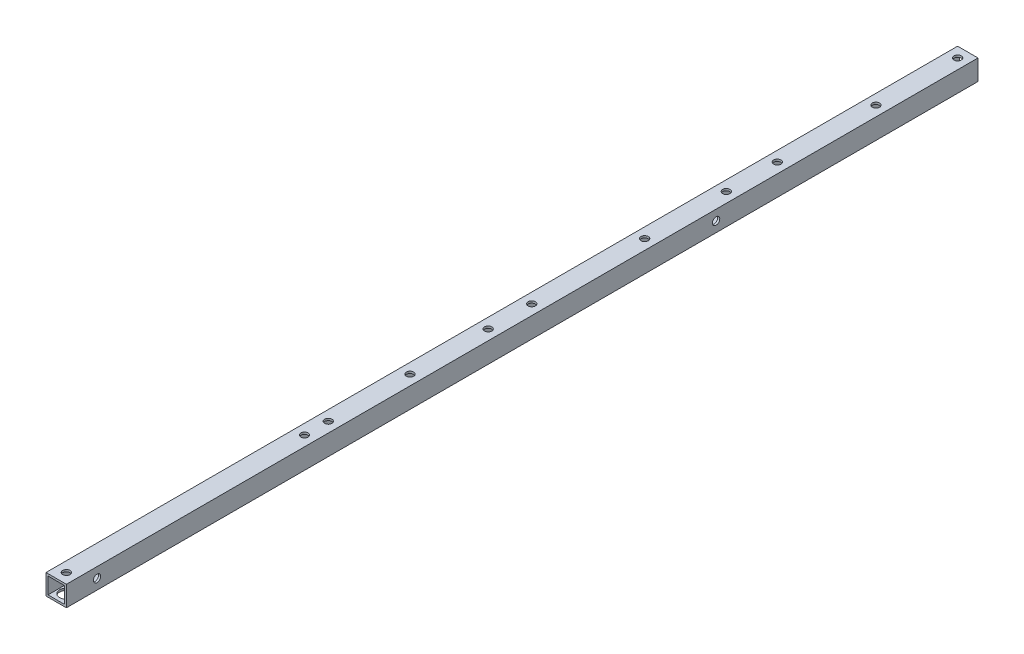
ISO-10303-21;
HEADER;
FILE_DESCRIPTION(('STEP AP214'),'2;1');
FILE_NAME('part.step','',(''),(''),'','','');
FILE_SCHEMA(('AUTOMOTIVE_DESIGN { 1 0 10303 214 1 1 1 1 }'));
ENDSEC;
DATA;
#1=APPLICATION_CONTEXT('core data for automotive mechanical design processes');
#2=APPLICATION_PROTOCOL_DEFINITION('international standard','automotive_design',2000,#1);
#3=PRODUCT_CONTEXT('',#1,'mechanical');
#4=PRODUCT('Part','Part','',(#3));
#5=PRODUCT_RELATED_PRODUCT_CATEGORY('part','',(#4));
#6=PRODUCT_DEFINITION_FORMATION('','',#4);
#7=PRODUCT_DEFINITION_CONTEXT('part definition',#1,'design');
#8=PRODUCT_DEFINITION('design','',#6,#7);
#9=PRODUCT_DEFINITION_SHAPE('','',#8);
#10=(LENGTH_UNIT() NAMED_UNIT(*) SI_UNIT(.MILLI.,.METRE.));
#11=(NAMED_UNIT(*) PLANE_ANGLE_UNIT() SI_UNIT($,.RADIAN.));
#12=(NAMED_UNIT(*) SI_UNIT($,.STERADIAN.) SOLID_ANGLE_UNIT());
#13=UNCERTAINTY_MEASURE_WITH_UNIT(LENGTH_MEASURE(1.E-05),#10,'distance_accuracy_value','');
#14=(GEOMETRIC_REPRESENTATION_CONTEXT(3) GLOBAL_UNCERTAINTY_ASSIGNED_CONTEXT((#13)) GLOBAL_UNIT_ASSIGNED_CONTEXT((#10,
#11,#12)) REPRESENTATION_CONTEXT('',''));
#15=CARTESIAN_POINT('',(0.,0.,0.));
#16=DIRECTION('',(0.,0.,1.));
#17=DIRECTION('',(1.,0.,0.));
#18=AXIS2_PLACEMENT_3D('',#15,#16,#17);
#19=CARTESIAN_POINT('',(-6.,-6.,670.));
#20=DIRECTION('',(0.,1.,0.));
#21=DIRECTION('',(0.,0.,1.));
#22=AXIS2_PLACEMENT_3D('',#19,#20,#21);
#23=PLANE('',#22);
#24=CARTESIAN_POINT('',(0.,-6.,320.5));
#25=DIRECTION('',(0.,1.,0.));
#26=DIRECTION('',(0.,0.,1.));
#27=AXIS2_PLACEMENT_3D('',#24,#25,#26);
#28=CIRCLE('',#27,4.99999999999999);
#29=CARTESIAN_POINT('',(0.,-6.,325.5));
#30=VERTEX_POINT('',#29);
#31=EDGE_CURVE('E638',#30,#30,#28,.F.);
#32=ORIENTED_EDGE('',*,*,#31,.T.);
#33=EDGE_LOOP('',(#32));
#34=FACE_BOUND('',#33,.T.);
#35=CARTESIAN_POINT('',(0.,-6.,662.5));
#36=DIRECTION('',(0.,1.,0.));
#37=DIRECTION('',(0.,0.,1.));
#38=AXIS2_PLACEMENT_3D('',#35,#36,#37);
#39=CIRCLE('',#38,5.00000000000001);
#40=CARTESIAN_POINT('',(0.,-6.,667.5));
#41=VERTEX_POINT('',#40);
#42=EDGE_CURVE('E196',#41,#41,#39,.T.);
#43=ORIENTED_EDGE('',*,*,#42,.F.);
#44=EDGE_LOOP('',(#43));
#45=FACE_BOUND('',#44,.T.);
#46=CARTESIAN_POINT('',(4.19131769982024E-12,-6.,410.));
#47=DIRECTION('',(0.,1.,0.));
#48=DIRECTION('',(0.,0.,1.));
#49=AXIS2_PLACEMENT_3D('',#46,#47,#48);
#50=CIRCLE('',#49,5.);
#51=CARTESIAN_POINT('',(4.19131769982024E-12,-6.,415.));
#52=VERTEX_POINT('',#51);
#53=EDGE_CURVE('E193',#52,#52,#50,.T.);
#54=ORIENTED_EDGE('',*,*,#53,.F.);
#55=EDGE_LOOP('',(#54));
#56=FACE_BOUND('',#55,.T.);
#57=CARTESIAN_POINT('',(5.84886213538092E-12,-6.,67.4999999999999));
#58=DIRECTION('',(0.,1.,0.));
#59=DIRECTION('',(0.,0.,1.));
#60=AXIS2_PLACEMENT_3D('',#57,#58,#59);
#61=CIRCLE('',#60,5.);
#62=CARTESIAN_POINT('',(5.84886213538092E-12,-6.,72.5));
#63=VERTEX_POINT('',#62);
#64=EDGE_CURVE('E190',#63,#63,#61,.T.);
#65=ORIENTED_EDGE('',*,*,#64,.F.);
#66=EDGE_LOOP('',(#65));
#67=FACE_BOUND('',#66,.T.);
#68=CARTESIAN_POINT('',(-3.10649990647104E-12,-6.,7.50000000000001));
#69=DIRECTION('',(0.,1.,0.));
#70=DIRECTION('',(0.,0.,1.));
#71=AXIS2_PLACEMENT_3D('',#68,#69,#70);
#72=CIRCLE('',#71,5.);
#73=CARTESIAN_POINT('',(-3.10649990647104E-12,-6.,12.5));
#74=VERTEX_POINT('',#73);
#75=EDGE_CURVE('E187',#74,#74,#72,.T.);
#76=ORIENTED_EDGE('',*,*,#75,.F.);
#77=EDGE_LOOP('',(#76));
#78=FACE_BOUND('',#77,.T.);
#79=CARTESIAN_POINT('',(0.,-6.,140.));
#80=DIRECTION('',(0.,1.,0.));
#81=DIRECTION('',(0.,0.,1.));
#82=AXIS2_PLACEMENT_3D('',#79,#80,#81);
#83=CIRCLE('',#82,5.);
#84=CARTESIAN_POINT('',(0.,-6.,145.));
#85=VERTEX_POINT('',#84);
#86=EDGE_CURVE('E184',#85,#85,#83,.T.);
#87=ORIENTED_EDGE('',*,*,#86,.F.);
#88=EDGE_LOOP('',(#87));
#89=FACE_BOUND('',#88,.T.);
#90=CARTESIAN_POINT('',(4.19131769982024E-12,-6.,470.));
#91=DIRECTION('',(0.,1.,0.));
#92=DIRECTION('',(0.,0.,1.));
#93=AXIS2_PLACEMENT_3D('',#90,#91,#92);
#94=CIRCLE('',#93,5.);
#95=CARTESIAN_POINT('',(4.19131769982024E-12,-6.,475.));
#96=VERTEX_POINT('',#95);
#97=EDGE_CURVE('E181',#96,#96,#94,.T.);
#98=ORIENTED_EDGE('',*,*,#97,.F.);
#99=EDGE_LOOP('',(#98));
#100=FACE_BOUND('',#99,.T.);
#101=CARTESIAN_POINT('',(0.,-6.,487.5));
#102=DIRECTION('',(0.,1.,0.));
#103=DIRECTION('',(0.,0.,1.));
#104=AXIS2_PLACEMENT_3D('',#101,#102,#103);
#105=CIRCLE('',#104,5.);
#106=CARTESIAN_POINT('',(0.,-6.,492.5));
#107=VERTEX_POINT('',#106);
#108=EDGE_CURVE('E178',#107,#107,#105,.T.);
#109=ORIENTED_EDGE('',*,*,#108,.F.);
#110=EDGE_LOOP('',(#109));
#111=FACE_BOUND('',#110,.T.);
#112=CARTESIAN_POINT('',(-4.63274860979666E-13,-6.,352.5));
#113=DIRECTION('',(0.,1.,0.));
#114=DIRECTION('',(0.,0.,1.));
#115=AXIS2_PLACEMENT_3D('',#112,#113,#114);
#116=CIRCLE('',#115,5.);
#117=CARTESIAN_POINT('',(-4.63274860979666E-13,-6.,357.5));
#118=VERTEX_POINT('',#117);
#119=EDGE_CURVE('E174',#118,#118,#116,.T.);
#120=ORIENTED_EDGE('',*,*,#119,.F.);
#121=EDGE_LOOP('',(#120));
#122=FACE_BOUND('',#121,.T.);
#123=CARTESIAN_POINT('',(0.,-6.,177.5));
#124=DIRECTION('',(0.,1.,0.));
#125=DIRECTION('',(0.,0.,1.));
#126=AXIS2_PLACEMENT_3D('',#123,#124,#125);
#127=CIRCLE('',#126,5.);
#128=CARTESIAN_POINT('',(0.,-6.,182.5));
#129=VERTEX_POINT('',#128);
#130=EDGE_CURVE('E171',#129,#129,#127,.T.);
#131=ORIENTED_EDGE('',*,*,#130,.F.);
#132=EDGE_LOOP('',(#131));
#133=FACE_BOUND('',#132,.T.);
#134=DIRECTION('',(1.,0.,0.));
#135=VECTOR('',#134,1.);
#136=CARTESIAN_POINT('',(-6.,-6.,0.));
#137=LINE('',#136,#135);
#138=CARTESIAN_POINT('',(-6.,-6.,0.));
#139=VERTEX_POINT('',#138);
#140=CARTESIAN_POINT('',(6.,-6.,0.));
#141=VERTEX_POINT('',#140);
#142=EDGE_CURVE('E116',#139,#141,#137,.T.);
#143=ORIENTED_EDGE('',*,*,#142,.F.);
#144=DIRECTION('',(0.,0.,-1.));
#145=VECTOR('',#144,1.);
#146=CARTESIAN_POINT('',(-6.,-6.,670.));
#147=LINE('',#146,#145);
#148=CARTESIAN_POINT('',(-6.,-6.,670.));
#149=VERTEX_POINT('',#148);
#150=EDGE_CURVE('E57',#149,#139,#147,.T.);
#151=ORIENTED_EDGE('',*,*,#150,.F.);
#152=DIRECTION('',(1.,0.,0.));
#153=VECTOR('',#152,1.);
#154=CARTESIAN_POINT('',(-6.,-6.,670.));
#155=LINE('',#154,#153);
#156=CARTESIAN_POINT('',(6.,-6.,670.));
#157=VERTEX_POINT('',#156);
#158=EDGE_CURVE('E130',#149,#157,#155,.T.);
#159=ORIENTED_EDGE('',*,*,#158,.T.);
#160=DIRECTION('',(0.,0.,-1.));
#161=VECTOR('',#160,1.);
#162=CARTESIAN_POINT('',(6.,-6.,670.));
#163=LINE('',#162,#161);
#164=EDGE_CURVE('E111',#157,#141,#163,.T.);
#165=ORIENTED_EDGE('',*,*,#164,.T.);
#166=EDGE_LOOP('',(#143,#151,#159,#165));
#167=FACE_BOUND('',#166,.T.);
#168=CARTESIAN_POINT('',(0.,-6.,237.5));
#169=DIRECTION('',(0.,1.,0.));
#170=DIRECTION('',(0.,0.,1.));
#171=AXIS2_PLACEMENT_3D('',#168,#169,#170);
#172=CIRCLE('',#171,4.99999999999999);
#173=CARTESIAN_POINT('',(0.,-6.,242.5));
#174=VERTEX_POINT('',#173);
#175=EDGE_CURVE('E628',#174,#174,#172,.F.);
#176=ORIENTED_EDGE('',*,*,#175,.T.);
#177=EDGE_LOOP('',(#176));
#178=FACE_BOUND('',#177,.T.);
#179=ADVANCED_FACE('F40',(#34,#45,#56,#67,#78,#89,#100,#111,#122,#133,#167,#178),#23,.T.);
#180=CARTESIAN_POINT('',(0.,0.,670.));
#181=DIRECTION('',(0.,0.,-1.));
#182=DIRECTION('',(-1.,0.,0.));
#183=AXIS2_PLACEMENT_3D('',#180,#181,#182);
#184=PLANE('',#183);
#185=DIRECTION('',(0.,1.,0.));
#186=VECTOR('',#185,1.);
#187=CARTESIAN_POINT('',(7.5,-7.5,670.));
#188=LINE('',#187,#186);
#189=CARTESIAN_POINT('',(7.5,-7.5,670.));
#190=VERTEX_POINT('',#189);
#191=CARTESIAN_POINT('',(7.5,7.5,670.));
#192=VERTEX_POINT('',#191);
#193=EDGE_CURVE('E146',#190,#192,#188,.T.);
#194=ORIENTED_EDGE('',*,*,#193,.T.);
#195=DIRECTION('',(-1.,0.,0.));
#196=VECTOR('',#195,1.);
#197=CARTESIAN_POINT('',(-7.5,7.5,670.));
#198=LINE('',#197,#196);
#199=CARTESIAN_POINT('',(-7.5,7.5,670.));
#200=VERTEX_POINT('',#199);
#201=EDGE_CURVE('E149',#192,#200,#198,.T.);
#202=ORIENTED_EDGE('',*,*,#201,.T.);
#203=DIRECTION('',(0.,-1.,0.));
#204=VECTOR('',#203,1.);
#205=CARTESIAN_POINT('',(-7.5,-7.5,670.));
#206=LINE('',#205,#204);
#207=CARTESIAN_POINT('',(-7.5,-7.5,670.));
#208=VERTEX_POINT('',#207);
#209=EDGE_CURVE('E152',#200,#208,#206,.T.);
#210=ORIENTED_EDGE('',*,*,#209,.T.);
#211=DIRECTION('',(1.,0.,0.));
#212=VECTOR('',#211,1.);
#213=CARTESIAN_POINT('',(-7.5,-7.5,670.));
#214=LINE('',#213,#212);
#215=EDGE_CURVE('E154',#208,#190,#214,.T.);
#216=ORIENTED_EDGE('',*,*,#215,.T.);
#217=EDGE_LOOP('',(#194,#202,#210,#216));
#218=FACE_BOUND('',#217,.T.);
#219=DIRECTION('',(0.,1.,0.));
#220=VECTOR('',#219,1.);
#221=CARTESIAN_POINT('',(6.,-6.,670.));
#222=LINE('',#221,#220);
#223=CARTESIAN_POINT('',(6.,6.,670.));
#224=VERTEX_POINT('',#223);
#225=EDGE_CURVE('E107',#157,#224,#222,.T.);
#226=ORIENTED_EDGE('',*,*,#225,.F.);
#227=ORIENTED_EDGE('',*,*,#158,.F.);
#228=DIRECTION('',(0.,-1.,0.));
#229=VECTOR('',#228,1.);
#230=CARTESIAN_POINT('',(-6.,-6.,670.));
#231=LINE('',#230,#229);
#232=CARTESIAN_POINT('',(-6.,6.,670.));
#233=VERTEX_POINT('',#232);
#234=EDGE_CURVE('E128',#233,#149,#231,.T.);
#235=ORIENTED_EDGE('',*,*,#234,.F.);
#236=DIRECTION('',(-1.,0.,0.));
#237=VECTOR('',#236,1.);
#238=CARTESIAN_POINT('',(-6.,6.,670.));
#239=LINE('',#238,#237);
#240=EDGE_CURVE('E115',#224,#233,#239,.T.);
#241=ORIENTED_EDGE('',*,*,#240,.F.);
#242=EDGE_LOOP('',(#226,#227,#235,#241));
#243=FACE_BOUND('',#242,.T.);
#244=ADVANCED_FACE('F127',(#218,#243),#184,.F.);
#245=CARTESIAN_POINT('',(0.,0.,0.));
#246=DIRECTION('',(0.,0.,-1.));
#247=DIRECTION('',(-1.,0.,0.));
#248=AXIS2_PLACEMENT_3D('',#245,#246,#247);
#249=PLANE('',#248);
#250=DIRECTION('',(0.,1.,0.));
#251=VECTOR('',#250,1.);
#252=CARTESIAN_POINT('',(7.5,-7.5,0.));
#253=LINE('',#252,#251);
#254=CARTESIAN_POINT('',(7.5,-7.5,0.));
#255=VERTEX_POINT('',#254);
#256=CARTESIAN_POINT('',(7.5,7.5,0.));
#257=VERTEX_POINT('',#256);
#258=EDGE_CURVE('E123',#255,#257,#253,.T.);
#259=ORIENTED_EDGE('',*,*,#258,.F.);
#260=DIRECTION('',(1.,0.,0.));
#261=VECTOR('',#260,1.);
#262=CARTESIAN_POINT('',(-7.5,-7.5,0.));
#263=LINE('',#262,#261);
#264=CARTESIAN_POINT('',(-7.5,-7.5,0.));
#265=VERTEX_POINT('',#264);
#266=EDGE_CURVE('E150',#265,#255,#263,.T.);
#267=ORIENTED_EDGE('',*,*,#266,.F.);
#268=DIRECTION('',(0.,-1.,0.));
#269=VECTOR('',#268,1.);
#270=CARTESIAN_POINT('',(-7.5,-7.5,0.));
#271=LINE('',#270,#269);
#272=CARTESIAN_POINT('',(-7.5,7.5,0.));
#273=VERTEX_POINT('',#272);
#274=EDGE_CURVE('E161',#273,#265,#271,.T.);
#275=ORIENTED_EDGE('',*,*,#274,.F.);
#276=DIRECTION('',(-1.,0.,0.));
#277=VECTOR('',#276,1.);
#278=CARTESIAN_POINT('',(-7.5,7.5,0.));
#279=LINE('',#278,#277);
#280=EDGE_CURVE('E159',#257,#273,#279,.T.);
#281=ORIENTED_EDGE('',*,*,#280,.F.);
#282=EDGE_LOOP('',(#259,#267,#275,#281));
#283=FACE_BOUND('',#282,.T.);
#284=ORIENTED_EDGE('',*,*,#142,.T.);
#285=DIRECTION('',(0.,1.,0.));
#286=VECTOR('',#285,1.);
#287=CARTESIAN_POINT('',(6.,-6.,0.));
#288=LINE('',#287,#286);
#289=CARTESIAN_POINT('',(6.,6.,0.));
#290=VERTEX_POINT('',#289);
#291=EDGE_CURVE('E65',#141,#290,#288,.T.);
#292=ORIENTED_EDGE('',*,*,#291,.T.);
#293=DIRECTION('',(-1.,0.,0.));
#294=VECTOR('',#293,1.);
#295=CARTESIAN_POINT('',(-6.,6.,0.));
#296=LINE('',#295,#294);
#297=CARTESIAN_POINT('',(-6.,6.,0.));
#298=VERTEX_POINT('',#297);
#299=EDGE_CURVE('E122',#290,#298,#296,.T.);
#300=ORIENTED_EDGE('',*,*,#299,.T.);
#301=DIRECTION('',(0.,-1.,0.));
#302=VECTOR('',#301,1.);
#303=CARTESIAN_POINT('',(-6.,-6.,0.));
#304=LINE('',#303,#302);
#305=EDGE_CURVE('E138',#298,#139,#304,.T.);
#306=ORIENTED_EDGE('',*,*,#305,.T.);
#307=EDGE_LOOP('',(#284,#292,#300,#306));
#308=FACE_BOUND('',#307,.T.);
#309=ADVANCED_FACE('F318',(#283,#308),#249,.T.);
#310=CARTESIAN_POINT('',(7.5,-7.5,670.));
#311=DIRECTION('',(-1.,0.,0.));
#312=DIRECTION('',(0.,0.,1.));
#313=AXIS2_PLACEMENT_3D('',#310,#311,#312);
#314=PLANE('',#313);
#315=CARTESIAN_POINT('',(7.5,0.,647.5));
#316=DIRECTION('',(1.,0.,0.));
#317=DIRECTION('',(0.,0.,-1.));
#318=AXIS2_PLACEMENT_3D('',#315,#316,#317);
#319=CIRCLE('',#318,2.70000000000001);
#320=CARTESIAN_POINT('',(7.5,0.,644.8));
#321=VERTEX_POINT('',#320);
#322=EDGE_CURVE('E289',#321,#321,#319,.T.);
#323=ORIENTED_EDGE('',*,*,#322,.F.);
#324=EDGE_LOOP('',(#323));
#325=FACE_BOUND('',#324,.T.);
#326=CARTESIAN_POINT('',(7.5,0.,192.5));
#327=DIRECTION('',(1.,0.,0.));
#328=DIRECTION('',(0.,0.,-1.));
#329=AXIS2_PLACEMENT_3D('',#326,#327,#328);
#330=CIRCLE('',#329,2.70000000000001);
#331=CARTESIAN_POINT('',(7.5,0.,189.8));
#332=VERTEX_POINT('',#331);
#333=EDGE_CURVE('E288',#332,#332,#330,.T.);
#334=ORIENTED_EDGE('',*,*,#333,.F.);
#335=EDGE_LOOP('',(#334));
#336=FACE_BOUND('',#335,.T.);
#337=ORIENTED_EDGE('',*,*,#258,.T.);
#338=DIRECTION('',(0.,0.,-1.));
#339=VECTOR('',#338,1.);
#340=CARTESIAN_POINT('',(7.5,7.5,670.));
#341=LINE('',#340,#339);
#342=EDGE_CURVE('E11',#192,#257,#341,.T.);
#343=ORIENTED_EDGE('',*,*,#342,.F.);
#344=ORIENTED_EDGE('',*,*,#193,.F.);
#345=DIRECTION('',(0.,0.,-1.));
#346=VECTOR('',#345,1.);
#347=CARTESIAN_POINT('',(7.5,-7.5,670.));
#348=LINE('',#347,#346);
#349=EDGE_CURVE('E156',#190,#255,#348,.T.);
#350=ORIENTED_EDGE('',*,*,#349,.T.);
#351=EDGE_LOOP('',(#337,#343,#344,#350));
#352=FACE_BOUND('',#351,.T.);
#353=ADVANCED_FACE('F42',(#325,#336,#352),#314,.F.);
#354=CARTESIAN_POINT('',(-7.5,7.5,670.));
#355=DIRECTION('',(0.,-1.,0.));
#356=DIRECTION('',(0.,0.,-1.));
#357=AXIS2_PLACEMENT_3D('',#354,#355,#356);
#358=PLANE('',#357);
#359=CARTESIAN_POINT('',(0.,7.5,237.5));
#360=DIRECTION('',(0.,1.,0.));
#361=DIRECTION('',(0.,0.,1.));
#362=AXIS2_PLACEMENT_3D('',#359,#360,#361);
#363=CIRCLE('',#362,2.69999999999999);
#364=CARTESIAN_POINT('',(0.,7.5,240.2));
#365=VERTEX_POINT('',#364);
#366=EDGE_CURVE('E640',#365,#365,#363,.T.);
#367=ORIENTED_EDGE('',*,*,#366,.F.);
#368=EDGE_LOOP('',(#367));
#369=FACE_BOUND('',#368,.T.);
#370=CARTESIAN_POINT('',(0.,7.5,320.5));
#371=DIRECTION('',(0.,1.,0.));
#372=DIRECTION('',(0.,0.,1.));
#373=AXIS2_PLACEMENT_3D('',#370,#371,#372);
#374=CIRCLE('',#373,2.69999999999999);
#375=CARTESIAN_POINT('',(0.,7.5,323.2));
#376=VERTEX_POINT('',#375);
#377=EDGE_CURVE('E643',#376,#376,#374,.T.);
#378=ORIENTED_EDGE('',*,*,#377,.F.);
#379=EDGE_LOOP('',(#378));
#380=FACE_BOUND('',#379,.T.);
#381=CARTESIAN_POINT('',(0.,7.5,7.5));
#382=DIRECTION('',(0.,1.,0.));
#383=DIRECTION('',(0.,0.,1.));
#384=AXIS2_PLACEMENT_3D('',#381,#382,#383);
#385=CIRCLE('',#384,2.7);
#386=CARTESIAN_POINT('',(0.,7.5,10.2));
#387=VERTEX_POINT('',#386);
#388=EDGE_CURVE('E235',#387,#387,#385,.T.);
#389=ORIENTED_EDGE('',*,*,#388,.F.);
#390=EDGE_LOOP('',(#389));
#391=FACE_BOUND('',#390,.T.);
#392=CARTESIAN_POINT('',(0.,7.5,67.4999999999999));
#393=DIRECTION('',(0.,1.,0.));
#394=DIRECTION('',(0.,0.,1.));
#395=AXIS2_PLACEMENT_3D('',#392,#393,#394);
#396=CIRCLE('',#395,2.7);
#397=CARTESIAN_POINT('',(0.,7.5,70.1999999999999));
#398=VERTEX_POINT('',#397);
#399=EDGE_CURVE('E239',#398,#398,#396,.T.);
#400=ORIENTED_EDGE('',*,*,#399,.F.);
#401=EDGE_LOOP('',(#400));
#402=FACE_BOUND('',#401,.T.);
#403=CARTESIAN_POINT('',(4.19131769982024E-12,7.5,410.));
#404=DIRECTION('',(0.,1.,0.));
#405=DIRECTION('',(0.,0.,1.));
#406=AXIS2_PLACEMENT_3D('',#403,#404,#405);
#407=CIRCLE('',#406,2.69999999999999);
#408=CARTESIAN_POINT('',(4.19131769982024E-12,7.5,412.7));
#409=VERTEX_POINT('',#408);
#410=EDGE_CURVE('E242',#409,#409,#407,.T.);
#411=ORIENTED_EDGE('',*,*,#410,.F.);
#412=EDGE_LOOP('',(#411));
#413=FACE_BOUND('',#412,.T.);
#414=CARTESIAN_POINT('',(4.19131769982024E-12,7.5,470.));
#415=DIRECTION('',(0.,1.,0.));
#416=DIRECTION('',(0.,0.,1.));
#417=AXIS2_PLACEMENT_3D('',#414,#415,#416);
#418=CIRCLE('',#417,2.69999999999999);
#419=CARTESIAN_POINT('',(4.19131769982024E-12,7.5,472.7));
#420=VERTEX_POINT('',#419);
#421=EDGE_CURVE('E199',#420,#420,#418,.T.);
#422=ORIENTED_EDGE('',*,*,#421,.F.);
#423=EDGE_LOOP('',(#422));
#424=FACE_BOUND('',#423,.T.);
#425=CARTESIAN_POINT('',(0.,7.5,662.5));
#426=DIRECTION('',(0.,1.,0.));
#427=DIRECTION('',(0.,0.,1.));
#428=AXIS2_PLACEMENT_3D('',#425,#426,#427);
#429=CIRCLE('',#428,2.69999999999999);
#430=CARTESIAN_POINT('',(0.,7.5,665.2));
#431=VERTEX_POINT('',#430);
#432=EDGE_CURVE('E259',#431,#431,#429,.T.);
#433=ORIENTED_EDGE('',*,*,#432,.F.);
#434=EDGE_LOOP('',(#433));
#435=FACE_BOUND('',#434,.T.);
#436=CARTESIAN_POINT('',(0.,7.5,487.5));
#437=DIRECTION('',(0.,1.,0.));
#438=DIRECTION('',(0.,0.,1.));
#439=AXIS2_PLACEMENT_3D('',#436,#437,#438);
#440=CIRCLE('',#439,2.69999999999999);
#441=CARTESIAN_POINT('',(0.,7.5,490.2));
#442=VERTEX_POINT('',#441);
#443=EDGE_CURVE('E258',#442,#442,#440,.T.);
#444=ORIENTED_EDGE('',*,*,#443,.F.);
#445=EDGE_LOOP('',(#444));
#446=FACE_BOUND('',#445,.T.);
#447=CARTESIAN_POINT('',(0.,7.5,140.));
#448=DIRECTION('',(0.,1.,0.));
#449=DIRECTION('',(0.,0.,1.));
#450=AXIS2_PLACEMENT_3D('',#447,#448,#449);
#451=CIRCLE('',#450,2.70000000000001);
#452=CARTESIAN_POINT('',(0.,7.5,142.7));
#453=VERTEX_POINT('',#452);
#454=EDGE_CURVE('E264',#453,#453,#451,.T.);
#455=ORIENTED_EDGE('',*,*,#454,.F.);
#456=EDGE_LOOP('',(#455));
#457=FACE_BOUND('',#456,.T.);
#458=CARTESIAN_POINT('',(0.,7.5,177.5));
#459=DIRECTION('',(0.,1.,0.));
#460=DIRECTION('',(0.,0.,1.));
#461=AXIS2_PLACEMENT_3D('',#458,#459,#460);
#462=CIRCLE('',#461,2.7);
#463=CARTESIAN_POINT('',(0.,7.5,180.2));
#464=VERTEX_POINT('',#463);
#465=EDGE_CURVE('E267',#464,#464,#462,.T.);
#466=ORIENTED_EDGE('',*,*,#465,.F.);
#467=EDGE_LOOP('',(#466));
#468=FACE_BOUND('',#467,.T.);
#469=CARTESIAN_POINT('',(-4.63274860979666E-13,7.5,352.5));
#470=DIRECTION('',(0.,1.,0.));
#471=DIRECTION('',(0.,0.,1.));
#472=AXIS2_PLACEMENT_3D('',#469,#470,#471);
#473=CIRCLE('',#472,2.69999999999999);
#474=CARTESIAN_POINT('',(-4.63274860979666E-13,7.5,355.2));
#475=VERTEX_POINT('',#474);
#476=EDGE_CURVE('E263',#475,#475,#473,.T.);
#477=ORIENTED_EDGE('',*,*,#476,.F.);
#478=EDGE_LOOP('',(#477));
#479=FACE_BOUND('',#478,.T.);
#480=ORIENTED_EDGE('',*,*,#280,.T.);
#481=DIRECTION('',(0.,0.,-1.));
#482=VECTOR('',#481,1.);
#483=CARTESIAN_POINT('',(-7.5,7.5,670.));
#484=LINE('',#483,#482);
#485=EDGE_CURVE('E49',#200,#273,#484,.T.);
#486=ORIENTED_EDGE('',*,*,#485,.F.);
#487=ORIENTED_EDGE('',*,*,#201,.F.);
#488=ORIENTED_EDGE('',*,*,#342,.T.);
#489=EDGE_LOOP('',(#480,#486,#487,#488));
#490=FACE_BOUND('',#489,.T.);
#491=ADVANCED_FACE('F317',(#369,#380,#391,#402,#413,#424,#435,#446,#457,#468,#479,#490),#358,.F.);
#492=CARTESIAN_POINT('',(-7.5,-7.5,670.));
#493=DIRECTION('',(1.,0.,0.));
#494=DIRECTION('',(0.,0.,-1.));
#495=AXIS2_PLACEMENT_3D('',#492,#493,#494);
#496=PLANE('',#495);
#497=CARTESIAN_POINT('',(-7.5,0.,192.5));
#498=DIRECTION('',(-1.,0.,0.));
#499=DIRECTION('',(0.,0.,1.));
#500=AXIS2_PLACEMENT_3D('',#497,#498,#499);
#501=CIRCLE('',#500,4.99999999999999);
#502=CARTESIAN_POINT('',(-7.5,0.,197.5));
#503=VERTEX_POINT('',#502);
#504=EDGE_CURVE('E203',#503,#503,#501,.T.);
#505=ORIENTED_EDGE('',*,*,#504,.F.);
#506=EDGE_LOOP('',(#505));
#507=FACE_BOUND('',#506,.T.);
#508=CARTESIAN_POINT('',(-7.5,0.,647.5));
#509=DIRECTION('',(-1.,0.,0.));
#510=DIRECTION('',(0.,0.,1.));
#511=AXIS2_PLACEMENT_3D('',#508,#509,#510);
#512=CIRCLE('',#511,5.00000000000004);
#513=CARTESIAN_POINT('',(-7.5,0.,652.5));
#514=VERTEX_POINT('',#513);
#515=EDGE_CURVE('E649',#514,#514,#512,.T.);
#516=ORIENTED_EDGE('',*,*,#515,.F.);
#517=EDGE_LOOP('',(#516));
#518=FACE_BOUND('',#517,.T.);
#519=ORIENTED_EDGE('',*,*,#274,.T.);
#520=DIRECTION('',(0.,0.,-1.));
#521=VECTOR('',#520,1.);
#522=CARTESIAN_POINT('',(-7.5,-7.5,670.));
#523=LINE('',#522,#521);
#524=EDGE_CURVE('E166',#208,#265,#523,.T.);
#525=ORIENTED_EDGE('',*,*,#524,.F.);
#526=ORIENTED_EDGE('',*,*,#209,.F.);
#527=ORIENTED_EDGE('',*,*,#485,.T.);
#528=EDGE_LOOP('',(#519,#525,#526,#527));
#529=FACE_BOUND('',#528,.T.);
#530=ADVANCED_FACE('F336',(#507,#518,#529),#496,.F.);
#531=CARTESIAN_POINT('',(-7.5,-7.5,670.));
#532=DIRECTION('',(0.,1.,0.));
#533=DIRECTION('',(0.,0.,1.));
#534=AXIS2_PLACEMENT_3D('',#531,#532,#533);
#535=PLANE('',#534);
#536=CARTESIAN_POINT('',(0.,-7.5,237.5));
#537=DIRECTION('',(0.,-1.,0.));
#538=DIRECTION('',(0.,0.,-1.));
#539=AXIS2_PLACEMENT_3D('',#536,#537,#538);
#540=CIRCLE('',#539,4.99999999999999);
#541=CARTESIAN_POINT('',(0.,-7.5,232.5));
#542=VERTEX_POINT('',#541);
#543=EDGE_CURVE('E631',#542,#542,#540,.T.);
#544=ORIENTED_EDGE('',*,*,#543,.F.);
#545=EDGE_LOOP('',(#544));
#546=FACE_BOUND('',#545,.T.);
#547=CARTESIAN_POINT('',(0.,-7.5,320.5));
#548=DIRECTION('',(0.,-1.,0.));
#549=DIRECTION('',(0.,0.,-1.));
#550=AXIS2_PLACEMENT_3D('',#547,#548,#549);
#551=CIRCLE('',#550,4.99999999999999);
#552=CARTESIAN_POINT('',(0.,-7.5,315.5));
#553=VERTEX_POINT('',#552);
#554=EDGE_CURVE('E633',#553,#553,#551,.T.);
#555=ORIENTED_EDGE('',*,*,#554,.F.);
#556=EDGE_LOOP('',(#555));
#557=FACE_BOUND('',#556,.T.);
#558=CARTESIAN_POINT('',(0.,-7.5,662.5));
#559=DIRECTION('',(0.,-1.,0.));
#560=DIRECTION('',(0.,0.,-1.));
#561=AXIS2_PLACEMENT_3D('',#558,#559,#560);
#562=CIRCLE('',#561,5.00000000000001);
#563=CARTESIAN_POINT('',(0.,-7.5,657.5));
#564=VERTEX_POINT('',#563);
#565=EDGE_CURVE('E175',#564,#564,#562,.T.);
#566=ORIENTED_EDGE('',*,*,#565,.F.);
#567=EDGE_LOOP('',(#566));
#568=FACE_BOUND('',#567,.T.);
#569=CARTESIAN_POINT('',(4.19131769982024E-12,-7.5,410.));
#570=DIRECTION('',(0.,-1.,0.));
#571=DIRECTION('',(0.,0.,-1.));
#572=AXIS2_PLACEMENT_3D('',#569,#570,#571);
#573=CIRCLE('',#572,5.);
#574=CARTESIAN_POINT('',(4.19131769982024E-12,-7.5,405.));
#575=VERTEX_POINT('',#574);
#576=EDGE_CURVE('E218',#575,#575,#573,.T.);
#577=ORIENTED_EDGE('',*,*,#576,.F.);
#578=EDGE_LOOP('',(#577));
#579=FACE_BOUND('',#578,.T.);
#580=CARTESIAN_POINT('',(5.84886213538092E-12,-7.5,67.4999999999999));
#581=DIRECTION('',(0.,-1.,0.));
#582=DIRECTION('',(0.,0.,-1.));
#583=AXIS2_PLACEMENT_3D('',#580,#581,#582);
#584=CIRCLE('',#583,5.);
#585=CARTESIAN_POINT('',(5.84886213538092E-12,-7.5,62.4999999999999));
#586=VERTEX_POINT('',#585);
#587=EDGE_CURVE('E214',#586,#586,#584,.T.);
#588=ORIENTED_EDGE('',*,*,#587,.F.);
#589=EDGE_LOOP('',(#588));
#590=FACE_BOUND('',#589,.T.);
#591=CARTESIAN_POINT('',(-3.10649990647104E-12,-7.5,7.50000000000001));
#592=DIRECTION('',(0.,-1.,0.));
#593=DIRECTION('',(0.,0.,-1.));
#594=AXIS2_PLACEMENT_3D('',#591,#592,#593);
#595=CIRCLE('',#594,5.);
#596=CARTESIAN_POINT('',(-3.10649990647104E-12,-7.5,2.5));
#597=VERTEX_POINT('',#596);
#598=EDGE_CURVE('E209',#597,#597,#595,.T.);
#599=ORIENTED_EDGE('',*,*,#598,.F.);
#600=EDGE_LOOP('',(#599));
#601=FACE_BOUND('',#600,.T.);
#602=CARTESIAN_POINT('',(0.,-7.5,140.));
#603=DIRECTION('',(0.,-1.,0.));
#604=DIRECTION('',(0.,0.,-1.));
#605=AXIS2_PLACEMENT_3D('',#602,#603,#604);
#606=CIRCLE('',#605,5.);
#607=CARTESIAN_POINT('',(0.,-7.5,135.));
#608=VERTEX_POINT('',#607);
#609=EDGE_CURVE('E205',#608,#608,#606,.T.);
#610=ORIENTED_EDGE('',*,*,#609,.F.);
#611=EDGE_LOOP('',(#610));
#612=FACE_BOUND('',#611,.T.);
#613=CARTESIAN_POINT('',(4.19131769982024E-12,-7.5,470.));
#614=DIRECTION('',(0.,-1.,0.));
#615=DIRECTION('',(0.,0.,-1.));
#616=AXIS2_PLACEMENT_3D('',#613,#614,#615);
#617=CIRCLE('',#616,5.);
#618=CARTESIAN_POINT('',(4.19131769982024E-12,-7.5,465.));
#619=VERTEX_POINT('',#618);
#620=EDGE_CURVE('E221',#619,#619,#617,.T.);
#621=ORIENTED_EDGE('',*,*,#620,.F.);
#622=EDGE_LOOP('',(#621));
#623=FACE_BOUND('',#622,.T.);
#624=CARTESIAN_POINT('',(0.,-7.5,487.5));
#625=DIRECTION('',(0.,-1.,0.));
#626=DIRECTION('',(0.,0.,-1.));
#627=AXIS2_PLACEMENT_3D('',#624,#625,#626);
#628=CIRCLE('',#627,5.);
#629=CARTESIAN_POINT('',(0.,-7.5,482.5));
#630=VERTEX_POINT('',#629);
#631=EDGE_CURVE('E230',#630,#630,#628,.T.);
#632=ORIENTED_EDGE('',*,*,#631,.F.);
#633=EDGE_LOOP('',(#632));
#634=FACE_BOUND('',#633,.T.);
#635=CARTESIAN_POINT('',(-4.63274860979666E-13,-7.5,352.5));
#636=DIRECTION('',(0.,-1.,0.));
#637=DIRECTION('',(0.,0.,-1.));
#638=AXIS2_PLACEMENT_3D('',#635,#636,#637);
#639=CIRCLE('',#638,5.);
#640=CARTESIAN_POINT('',(-4.63274860979666E-13,-7.5,347.5));
#641=VERTEX_POINT('',#640);
#642=EDGE_CURVE('E227',#641,#641,#639,.T.);
#643=ORIENTED_EDGE('',*,*,#642,.F.);
#644=EDGE_LOOP('',(#643));
#645=FACE_BOUND('',#644,.T.);
#646=CARTESIAN_POINT('',(0.,-7.5,177.5));
#647=DIRECTION('',(0.,-1.,0.));
#648=DIRECTION('',(0.,0.,-1.));
#649=AXIS2_PLACEMENT_3D('',#646,#647,#648);
#650=CIRCLE('',#649,5.);
#651=CARTESIAN_POINT('',(0.,-7.5,172.5));
#652=VERTEX_POINT('',#651);
#653=EDGE_CURVE('E224',#652,#652,#650,.T.);
#654=ORIENTED_EDGE('',*,*,#653,.F.);
#655=EDGE_LOOP('',(#654));
#656=FACE_BOUND('',#655,.T.);
#657=ORIENTED_EDGE('',*,*,#266,.T.);
#658=ORIENTED_EDGE('',*,*,#349,.F.);
#659=ORIENTED_EDGE('',*,*,#215,.F.);
#660=ORIENTED_EDGE('',*,*,#524,.T.);
#661=EDGE_LOOP('',(#657,#658,#659,#660));
#662=FACE_BOUND('',#661,.T.);
#663=ADVANCED_FACE('F304',(#546,#557,#568,#579,#590,#601,#612,#623,#634,#645,#656,#662),#535,.F.);
#664=CARTESIAN_POINT('',(6.,-6.,670.));
#665=DIRECTION('',(-1.,0.,0.));
#666=DIRECTION('',(0.,0.,1.));
#667=AXIS2_PLACEMENT_3D('',#664,#665,#666);
#668=PLANE('',#667);
#669=CARTESIAN_POINT('',(6.,0.,647.5));
#670=DIRECTION('',(-1.,0.,0.));
#671=DIRECTION('',(0.,0.,1.));
#672=AXIS2_PLACEMENT_3D('',#669,#670,#671);
#673=CIRCLE('',#672,2.70000000000001);
#674=CARTESIAN_POINT('',(6.,0.,650.2));
#675=VERTEX_POINT('',#674);
#676=EDGE_CURVE('E136',#675,#675,#673,.T.);
#677=ORIENTED_EDGE('',*,*,#676,.F.);
#678=EDGE_LOOP('',(#677));
#679=FACE_BOUND('',#678,.T.);
#680=CARTESIAN_POINT('',(6.,0.,192.5));
#681=DIRECTION('',(-1.,0.,0.));
#682=DIRECTION('',(0.,0.,1.));
#683=AXIS2_PLACEMENT_3D('',#680,#681,#682);
#684=CIRCLE('',#683,2.70000000000001);
#685=CARTESIAN_POINT('',(6.,0.,195.2));
#686=VERTEX_POINT('',#685);
#687=EDGE_CURVE('E292',#686,#686,#684,.T.);
#688=ORIENTED_EDGE('',*,*,#687,.F.);
#689=EDGE_LOOP('',(#688));
#690=FACE_BOUND('',#689,.T.);
#691=ORIENTED_EDGE('',*,*,#291,.F.);
#692=ORIENTED_EDGE('',*,*,#164,.F.);
#693=ORIENTED_EDGE('',*,*,#225,.T.);
#694=DIRECTION('',(0.,0.,-1.));
#695=VECTOR('',#694,1.);
#696=CARTESIAN_POINT('',(6.,6.,670.));
#697=LINE('',#696,#695);
#698=EDGE_CURVE('E110',#224,#290,#697,.T.);
#699=ORIENTED_EDGE('',*,*,#698,.T.);
#700=EDGE_LOOP('',(#691,#692,#693,#699));
#701=FACE_BOUND('',#700,.T.);
#702=ADVANCED_FACE('F109',(#679,#690,#701),#668,.T.);
#703=CARTESIAN_POINT('',(-6.,6.,670.));
#704=DIRECTION('',(0.,-1.,0.));
#705=DIRECTION('',(0.,0.,-1.));
#706=AXIS2_PLACEMENT_3D('',#703,#704,#705);
#707=PLANE('',#706);
#708=CARTESIAN_POINT('',(0.,6.,237.5));
#709=DIRECTION('',(0.,-1.,0.));
#710=DIRECTION('',(0.,0.,-1.));
#711=AXIS2_PLACEMENT_3D('',#708,#709,#710);
#712=CIRCLE('',#711,2.69999999999999);
#713=CARTESIAN_POINT('',(0.,6.,234.8));
#714=VERTEX_POINT('',#713);
#715=EDGE_CURVE('E44',#714,#714,#712,.T.);
#716=ORIENTED_EDGE('',*,*,#715,.F.);
#717=EDGE_LOOP('',(#716));
#718=FACE_BOUND('',#717,.T.);
#719=CARTESIAN_POINT('',(0.,6.,320.5));
#720=DIRECTION('',(0.,-1.,0.));
#721=DIRECTION('',(0.,0.,-1.));
#722=AXIS2_PLACEMENT_3D('',#719,#720,#721);
#723=CIRCLE('',#722,2.69999999999999);
#724=CARTESIAN_POINT('',(0.,6.,317.8));
#725=VERTEX_POINT('',#724);
#726=EDGE_CURVE('E646',#725,#725,#723,.T.);
#727=ORIENTED_EDGE('',*,*,#726,.F.);
#728=EDGE_LOOP('',(#727));
#729=FACE_BOUND('',#728,.T.);
#730=CARTESIAN_POINT('',(0.,6.,7.5));
#731=DIRECTION('',(0.,-1.,0.));
#732=DIRECTION('',(0.,0.,-1.));
#733=AXIS2_PLACEMENT_3D('',#730,#731,#732);
#734=CIRCLE('',#733,2.7);
#735=CARTESIAN_POINT('',(0.,6.,4.8));
#736=VERTEX_POINT('',#735);
#737=EDGE_CURVE('E255',#736,#736,#734,.T.);
#738=ORIENTED_EDGE('',*,*,#737,.F.);
#739=EDGE_LOOP('',(#738));
#740=FACE_BOUND('',#739,.T.);
#741=CARTESIAN_POINT('',(0.,6.,67.4999999999999));
#742=DIRECTION('',(0.,-1.,0.));
#743=DIRECTION('',(0.,0.,-1.));
#744=AXIS2_PLACEMENT_3D('',#741,#742,#743);
#745=CIRCLE('',#744,2.7);
#746=CARTESIAN_POINT('',(0.,6.,64.7999999999999));
#747=VERTEX_POINT('',#746);
#748=EDGE_CURVE('E252',#747,#747,#745,.T.);
#749=ORIENTED_EDGE('',*,*,#748,.F.);
#750=EDGE_LOOP('',(#749));
#751=FACE_BOUND('',#750,.T.);
#752=CARTESIAN_POINT('',(4.19131769982024E-12,6.,410.));
#753=DIRECTION('',(0.,-1.,0.));
#754=DIRECTION('',(0.,0.,-1.));
#755=AXIS2_PLACEMENT_3D('',#752,#753,#754);
#756=CIRCLE('',#755,2.69999999999999);
#757=CARTESIAN_POINT('',(4.19131769982024E-12,6.,407.3));
#758=VERTEX_POINT('',#757);
#759=EDGE_CURVE('E249',#758,#758,#756,.T.);
#760=ORIENTED_EDGE('',*,*,#759,.F.);
#761=EDGE_LOOP('',(#760));
#762=FACE_BOUND('',#761,.T.);
#763=CARTESIAN_POINT('',(4.19131769982024E-12,6.,470.));
#764=DIRECTION('',(0.,-1.,0.));
#765=DIRECTION('',(0.,0.,-1.));
#766=AXIS2_PLACEMENT_3D('',#763,#764,#765);
#767=CIRCLE('',#766,2.69999999999999);
#768=CARTESIAN_POINT('',(4.19131769982024E-12,6.,467.3));
#769=VERTEX_POINT('',#768);
#770=EDGE_CURVE('E238',#769,#769,#767,.T.);
#771=ORIENTED_EDGE('',*,*,#770,.F.);
#772=EDGE_LOOP('',(#771));
#773=FACE_BOUND('',#772,.T.);
#774=CARTESIAN_POINT('',(0.,6.,662.5));
#775=DIRECTION('',(0.,-1.,0.));
#776=DIRECTION('',(0.,0.,-1.));
#777=AXIS2_PLACEMENT_3D('',#774,#775,#776);
#778=CIRCLE('',#777,2.69999999999999);
#779=CARTESIAN_POINT('',(0.,6.,659.8));
#780=VERTEX_POINT('',#779);
#781=EDGE_CURVE('E285',#780,#780,#778,.T.);
#782=ORIENTED_EDGE('',*,*,#781,.F.);
#783=EDGE_LOOP('',(#782));
#784=FACE_BOUND('',#783,.T.);
#785=CARTESIAN_POINT('',(0.,6.,487.5));
#786=DIRECTION('',(0.,-1.,0.));
#787=DIRECTION('',(0.,0.,-1.));
#788=AXIS2_PLACEMENT_3D('',#785,#786,#787);
#789=CIRCLE('',#788,2.69999999999999);
#790=CARTESIAN_POINT('',(0.,6.,484.8));
#791=VERTEX_POINT('',#790);
#792=EDGE_CURVE('E282',#791,#791,#789,.T.);
#793=ORIENTED_EDGE('',*,*,#792,.F.);
#794=EDGE_LOOP('',(#793));
#795=FACE_BOUND('',#794,.T.);
#796=CARTESIAN_POINT('',(0.,6.,140.));
#797=DIRECTION('',(0.,-1.,0.));
#798=DIRECTION('',(0.,0.,-1.));
#799=AXIS2_PLACEMENT_3D('',#796,#797,#798);
#800=CIRCLE('',#799,2.70000000000001);
#801=CARTESIAN_POINT('',(0.,6.,137.3));
#802=VERTEX_POINT('',#801);
#803=EDGE_CURVE('E279',#802,#802,#800,.T.);
#804=ORIENTED_EDGE('',*,*,#803,.F.);
#805=EDGE_LOOP('',(#804));
#806=FACE_BOUND('',#805,.T.);
#807=CARTESIAN_POINT('',(0.,6.,177.5));
#808=DIRECTION('',(0.,-1.,0.));
#809=DIRECTION('',(0.,0.,-1.));
#810=AXIS2_PLACEMENT_3D('',#807,#808,#809);
#811=CIRCLE('',#810,2.7);
#812=CARTESIAN_POINT('',(0.,6.,174.8));
#813=VERTEX_POINT('',#812);
#814=EDGE_CURVE('E276',#813,#813,#811,.T.);
#815=ORIENTED_EDGE('',*,*,#814,.F.);
#816=EDGE_LOOP('',(#815));
#817=FACE_BOUND('',#816,.T.);
#818=CARTESIAN_POINT('',(-4.63274860979666E-13,6.,352.5));
#819=DIRECTION('',(0.,-1.,0.));
#820=DIRECTION('',(0.,0.,-1.));
#821=AXIS2_PLACEMENT_3D('',#818,#819,#820);
#822=CIRCLE('',#821,2.69999999999999);
#823=CARTESIAN_POINT('',(-4.63274860979666E-13,6.,349.8));
#824=VERTEX_POINT('',#823);
#825=EDGE_CURVE('E262',#824,#824,#822,.T.);
#826=ORIENTED_EDGE('',*,*,#825,.F.);
#827=EDGE_LOOP('',(#826));
#828=FACE_BOUND('',#827,.T.);
#829=ORIENTED_EDGE('',*,*,#299,.F.);
#830=ORIENTED_EDGE('',*,*,#698,.F.);
#831=ORIENTED_EDGE('',*,*,#240,.T.);
#832=DIRECTION('',(0.,0.,-1.));
#833=VECTOR('',#832,1.);
#834=CARTESIAN_POINT('',(-6.,6.,670.));
#835=LINE('',#834,#833);
#836=EDGE_CURVE('E124',#233,#298,#835,.T.);
#837=ORIENTED_EDGE('',*,*,#836,.T.);
#838=EDGE_LOOP('',(#829,#830,#831,#837));
#839=FACE_BOUND('',#838,.T.);
#840=ADVANCED_FACE('F119',(#718,#729,#740,#751,#762,#773,#784,#795,#806,#817,#828,#839),#707,.T.);
#841=CARTESIAN_POINT('',(-6.,-6.,670.));
#842=DIRECTION('',(1.,0.,0.));
#843=DIRECTION('',(0.,0.,-1.));
#844=AXIS2_PLACEMENT_3D('',#841,#842,#843);
#845=PLANE('',#844);
#846=CARTESIAN_POINT('',(-6.,0.,192.5));
#847=DIRECTION('',(1.,0.,0.));
#848=DIRECTION('',(0.,0.,-1.));
#849=AXIS2_PLACEMENT_3D('',#846,#847,#848);
#850=CIRCLE('',#849,4.99999999999999);
#851=CARTESIAN_POINT('',(-6.,0.,187.5));
#852=VERTEX_POINT('',#851);
#853=EDGE_CURVE('E202',#852,#852,#850,.T.);
#854=ORIENTED_EDGE('',*,*,#853,.F.);
#855=EDGE_LOOP('',(#854));
#856=FACE_BOUND('',#855,.T.);
#857=CARTESIAN_POINT('',(-6.,0.,647.5));
#858=DIRECTION('',(1.,0.,0.));
#859=DIRECTION('',(0.,0.,-1.));
#860=AXIS2_PLACEMENT_3D('',#857,#858,#859);
#861=CIRCLE('',#860,5.00000000000004);
#862=CARTESIAN_POINT('',(-6.,0.,642.5));
#863=VERTEX_POINT('',#862);
#864=EDGE_CURVE('E200',#863,#863,#861,.T.);
#865=ORIENTED_EDGE('',*,*,#864,.F.);
#866=EDGE_LOOP('',(#865));
#867=FACE_BOUND('',#866,.T.);
#868=ORIENTED_EDGE('',*,*,#305,.F.);
#869=ORIENTED_EDGE('',*,*,#836,.F.);
#870=ORIENTED_EDGE('',*,*,#234,.T.);
#871=ORIENTED_EDGE('',*,*,#150,.T.);
#872=EDGE_LOOP('',(#868,#869,#870,#871));
#873=FACE_BOUND('',#872,.T.);
#874=ADVANCED_FACE('F311',(#856,#867,#873),#845,.T.);
#875=CARTESIAN_POINT('',(-12.5,0.,192.5));
#876=DIRECTION('',(1.,0.,0.));
#877=DIRECTION('',(0.,0.,-1.));
#878=AXIS2_PLACEMENT_3D('',#875,#876,#877);
#879=CYLINDRICAL_SURFACE('',#878,2.70000000000001);
#880=ORIENTED_EDGE('',*,*,#687,.T.);
#881=EDGE_LOOP('',(#880));
#882=FACE_BOUND('',#881,.T.);
#883=ORIENTED_EDGE('',*,*,#333,.T.);
#884=EDGE_LOOP('',(#883));
#885=FACE_BOUND('',#884,.T.);
#886=ADVANCED_FACE('F308',(#882,#885),#879,.F.);
#887=CARTESIAN_POINT('',(-12.5,0.,647.5));
#888=DIRECTION('',(1.,0.,0.));
#889=DIRECTION('',(0.,0.,-1.));
#890=AXIS2_PLACEMENT_3D('',#887,#888,#889);
#891=CYLINDRICAL_SURFACE('',#890,2.70000000000001);
#892=ORIENTED_EDGE('',*,*,#676,.T.);
#893=EDGE_LOOP('',(#892));
#894=FACE_BOUND('',#893,.T.);
#895=ORIENTED_EDGE('',*,*,#322,.T.);
#896=EDGE_LOOP('',(#895));
#897=FACE_BOUND('',#896,.T.);
#898=ADVANCED_FACE('F299',(#894,#897),#891,.F.);
#899=CARTESIAN_POINT('',(-4.63274860979666E-13,-22.5,352.5));
#900=DIRECTION('',(0.,1.,0.));
#901=DIRECTION('',(0.,0.,1.));
#902=AXIS2_PLACEMENT_3D('',#899,#900,#901);
#903=CYLINDRICAL_SURFACE('',#902,2.69999999999999);
#904=ORIENTED_EDGE('',*,*,#825,.T.);
#905=EDGE_LOOP('',(#904));
#906=FACE_BOUND('',#905,.T.);
#907=ORIENTED_EDGE('',*,*,#476,.T.);
#908=EDGE_LOOP('',(#907));
#909=FACE_BOUND('',#908,.T.);
#910=ADVANCED_FACE('F399',(#906,#909),#903,.F.);
#911=CARTESIAN_POINT('',(0.,-22.5,177.5));
#912=DIRECTION('',(0.,1.,0.));
#913=DIRECTION('',(0.,0.,1.));
#914=AXIS2_PLACEMENT_3D('',#911,#912,#913);
#915=CYLINDRICAL_SURFACE('',#914,2.7);
#916=ORIENTED_EDGE('',*,*,#814,.T.);
#917=EDGE_LOOP('',(#916));
#918=FACE_BOUND('',#917,.T.);
#919=ORIENTED_EDGE('',*,*,#465,.T.);
#920=EDGE_LOOP('',(#919));
#921=FACE_BOUND('',#920,.T.);
#922=ADVANCED_FACE('F406',(#918,#921),#915,.F.);
#923=CARTESIAN_POINT('',(0.,-22.5,140.));
#924=DIRECTION('',(0.,1.,0.));
#925=DIRECTION('',(0.,0.,1.));
#926=AXIS2_PLACEMENT_3D('',#923,#924,#925);
#927=CYLINDRICAL_SURFACE('',#926,2.70000000000001);
#928=ORIENTED_EDGE('',*,*,#803,.T.);
#929=EDGE_LOOP('',(#928));
#930=FACE_BOUND('',#929,.T.);
#931=ORIENTED_EDGE('',*,*,#454,.T.);
#932=EDGE_LOOP('',(#931));
#933=FACE_BOUND('',#932,.T.);
#934=ADVANCED_FACE('F415',(#930,#933),#927,.F.);
#935=CARTESIAN_POINT('',(0.,-22.5,487.5));
#936=DIRECTION('',(0.,1.,0.));
#937=DIRECTION('',(0.,0.,1.));
#938=AXIS2_PLACEMENT_3D('',#935,#936,#937);
#939=CYLINDRICAL_SURFACE('',#938,2.69999999999999);
#940=ORIENTED_EDGE('',*,*,#792,.T.);
#941=EDGE_LOOP('',(#940));
#942=FACE_BOUND('',#941,.T.);
#943=ORIENTED_EDGE('',*,*,#443,.T.);
#944=EDGE_LOOP('',(#943));
#945=FACE_BOUND('',#944,.T.);
#946=ADVANCED_FACE('F424',(#942,#945),#939,.F.);
#947=CARTESIAN_POINT('',(0.,-22.5,662.5));
#948=DIRECTION('',(0.,1.,0.));
#949=DIRECTION('',(0.,0.,1.));
#950=AXIS2_PLACEMENT_3D('',#947,#948,#949);
#951=CYLINDRICAL_SURFACE('',#950,2.69999999999999);
#952=ORIENTED_EDGE('',*,*,#781,.T.);
#953=EDGE_LOOP('',(#952));
#954=FACE_BOUND('',#953,.T.);
#955=ORIENTED_EDGE('',*,*,#432,.T.);
#956=EDGE_LOOP('',(#955));
#957=FACE_BOUND('',#956,.T.);
#958=ADVANCED_FACE('F433',(#954,#957),#951,.F.);
#959=CARTESIAN_POINT('',(4.19131769982024E-12,-32.5,470.));
#960=DIRECTION('',(0.,1.,0.));
#961=DIRECTION('',(0.,0.,1.));
#962=AXIS2_PLACEMENT_3D('',#959,#960,#961);
#963=CYLINDRICAL_SURFACE('',#962,2.69999999999999);
#964=ORIENTED_EDGE('',*,*,#770,.T.);
#965=EDGE_LOOP('',(#964));
#966=FACE_BOUND('',#965,.T.);
#967=ORIENTED_EDGE('',*,*,#421,.T.);
#968=EDGE_LOOP('',(#967));
#969=FACE_BOUND('',#968,.T.);
#970=ADVANCED_FACE('F442',(#966,#969),#963,.F.);
#971=CARTESIAN_POINT('',(4.19131769982024E-12,-32.5,410.));
#972=DIRECTION('',(0.,1.,0.));
#973=DIRECTION('',(0.,0.,1.));
#974=AXIS2_PLACEMENT_3D('',#971,#972,#973);
#975=CYLINDRICAL_SURFACE('',#974,2.69999999999999);
#976=ORIENTED_EDGE('',*,*,#759,.T.);
#977=EDGE_LOOP('',(#976));
#978=FACE_BOUND('',#977,.T.);
#979=ORIENTED_EDGE('',*,*,#410,.T.);
#980=EDGE_LOOP('',(#979));
#981=FACE_BOUND('',#980,.T.);
#982=ADVANCED_FACE('F451',(#978,#981),#975,.F.);
#983=CARTESIAN_POINT('',(0.,-32.5,67.4999999999999));
#984=DIRECTION('',(0.,1.,0.));
#985=DIRECTION('',(0.,0.,1.));
#986=AXIS2_PLACEMENT_3D('',#983,#984,#985);
#987=CYLINDRICAL_SURFACE('',#986,2.7);
#988=ORIENTED_EDGE('',*,*,#748,.T.);
#989=EDGE_LOOP('',(#988));
#990=FACE_BOUND('',#989,.T.);
#991=ORIENTED_EDGE('',*,*,#399,.T.);
#992=EDGE_LOOP('',(#991));
#993=FACE_BOUND('',#992,.T.);
#994=ADVANCED_FACE('F460',(#990,#993),#987,.F.);
#995=CARTESIAN_POINT('',(0.,-32.5,7.5));
#996=DIRECTION('',(0.,1.,0.));
#997=DIRECTION('',(0.,0.,1.));
#998=AXIS2_PLACEMENT_3D('',#995,#996,#997);
#999=CYLINDRICAL_SURFACE('',#998,2.7);
#1000=ORIENTED_EDGE('',*,*,#737,.T.);
#1001=EDGE_LOOP('',(#1000));
#1002=FACE_BOUND('',#1001,.T.);
#1003=ORIENTED_EDGE('',*,*,#388,.T.);
#1004=EDGE_LOOP('',(#1003));
#1005=FACE_BOUND('',#1004,.T.);
#1006=ADVANCED_FACE('F469',(#1002,#1005),#999,.F.);
#1007=CARTESIAN_POINT('',(0.,2.5,177.5));
#1008=DIRECTION('',(0.,-1.,0.));
#1009=DIRECTION('',(0.,0.,-1.));
#1010=AXIS2_PLACEMENT_3D('',#1007,#1008,#1009);
#1011=CYLINDRICAL_SURFACE('',#1010,5.);
#1012=ORIENTED_EDGE('',*,*,#130,.T.);
#1013=EDGE_LOOP('',(#1012));
#1014=FACE_BOUND('',#1013,.T.);
#1015=ORIENTED_EDGE('',*,*,#653,.T.);
#1016=EDGE_LOOP('',(#1015));
#1017=FACE_BOUND('',#1016,.T.);
#1018=ADVANCED_FACE('F478',(#1014,#1017),#1011,.F.);
#1019=CARTESIAN_POINT('',(-4.63274860979666E-13,2.5,352.5));
#1020=DIRECTION('',(0.,-1.,0.));
#1021=DIRECTION('',(0.,0.,-1.));
#1022=AXIS2_PLACEMENT_3D('',#1019,#1020,#1021);
#1023=CYLINDRICAL_SURFACE('',#1022,5.);
#1024=ORIENTED_EDGE('',*,*,#119,.T.);
#1025=EDGE_LOOP('',(#1024));
#1026=FACE_BOUND('',#1025,.T.);
#1027=ORIENTED_EDGE('',*,*,#642,.T.);
#1028=EDGE_LOOP('',(#1027));
#1029=FACE_BOUND('',#1028,.T.);
#1030=ADVANCED_FACE('F487',(#1026,#1029),#1023,.F.);
#1031=CARTESIAN_POINT('',(0.,2.5,487.5));
#1032=DIRECTION('',(0.,-1.,0.));
#1033=DIRECTION('',(0.,0.,-1.));
#1034=AXIS2_PLACEMENT_3D('',#1031,#1032,#1033);
#1035=CYLINDRICAL_SURFACE('',#1034,5.);
#1036=ORIENTED_EDGE('',*,*,#108,.T.);
#1037=EDGE_LOOP('',(#1036));
#1038=FACE_BOUND('',#1037,.T.);
#1039=ORIENTED_EDGE('',*,*,#631,.T.);
#1040=EDGE_LOOP('',(#1039));
#1041=FACE_BOUND('',#1040,.T.);
#1042=ADVANCED_FACE('F496',(#1038,#1041),#1035,.F.);
#1043=CARTESIAN_POINT('',(4.19131769982024E-12,2.5,470.));
#1044=DIRECTION('',(0.,-1.,0.));
#1045=DIRECTION('',(0.,0.,-1.));
#1046=AXIS2_PLACEMENT_3D('',#1043,#1044,#1045);
#1047=CYLINDRICAL_SURFACE('',#1046,5.);
#1048=ORIENTED_EDGE('',*,*,#97,.T.);
#1049=EDGE_LOOP('',(#1048));
#1050=FACE_BOUND('',#1049,.T.);
#1051=ORIENTED_EDGE('',*,*,#620,.T.);
#1052=EDGE_LOOP('',(#1051));
#1053=FACE_BOUND('',#1052,.T.);
#1054=ADVANCED_FACE('F505',(#1050,#1053),#1047,.F.);
#1055=CARTESIAN_POINT('',(0.,2.5,140.));
#1056=DIRECTION('',(0.,-1.,0.));
#1057=DIRECTION('',(0.,0.,-1.));
#1058=AXIS2_PLACEMENT_3D('',#1055,#1056,#1057);
#1059=CYLINDRICAL_SURFACE('',#1058,5.);
#1060=ORIENTED_EDGE('',*,*,#86,.T.);
#1061=EDGE_LOOP('',(#1060));
#1062=FACE_BOUND('',#1061,.T.);
#1063=ORIENTED_EDGE('',*,*,#609,.T.);
#1064=EDGE_LOOP('',(#1063));
#1065=FACE_BOUND('',#1064,.T.);
#1066=ADVANCED_FACE('F514',(#1062,#1065),#1059,.F.);
#1067=CARTESIAN_POINT('',(-3.10649990647104E-12,2.5,7.50000000000001));
#1068=DIRECTION('',(0.,-1.,0.));
#1069=DIRECTION('',(0.,0.,-1.));
#1070=AXIS2_PLACEMENT_3D('',#1067,#1068,#1069);
#1071=CYLINDRICAL_SURFACE('',#1070,5.);
#1072=ORIENTED_EDGE('',*,*,#75,.T.);
#1073=EDGE_LOOP('',(#1072));
#1074=FACE_BOUND('',#1073,.T.);
#1075=ORIENTED_EDGE('',*,*,#598,.T.);
#1076=EDGE_LOOP('',(#1075));
#1077=FACE_BOUND('',#1076,.T.);
#1078=ADVANCED_FACE('F523',(#1074,#1077),#1071,.F.);
#1079=CARTESIAN_POINT('',(5.84886213538092E-12,2.5,67.4999999999999));
#1080=DIRECTION('',(0.,-1.,0.));
#1081=DIRECTION('',(0.,0.,-1.));
#1082=AXIS2_PLACEMENT_3D('',#1079,#1080,#1081);
#1083=CYLINDRICAL_SURFACE('',#1082,5.);
#1084=ORIENTED_EDGE('',*,*,#64,.T.);
#1085=EDGE_LOOP('',(#1084));
#1086=FACE_BOUND('',#1085,.T.);
#1087=ORIENTED_EDGE('',*,*,#587,.T.);
#1088=EDGE_LOOP('',(#1087));
#1089=FACE_BOUND('',#1088,.T.);
#1090=ADVANCED_FACE('F532',(#1086,#1089),#1083,.F.);
#1091=CARTESIAN_POINT('',(4.19131769982024E-12,2.5,410.));
#1092=DIRECTION('',(0.,-1.,0.));
#1093=DIRECTION('',(0.,0.,-1.));
#1094=AXIS2_PLACEMENT_3D('',#1091,#1092,#1093);
#1095=CYLINDRICAL_SURFACE('',#1094,5.);
#1096=ORIENTED_EDGE('',*,*,#53,.T.);
#1097=EDGE_LOOP('',(#1096));
#1098=FACE_BOUND('',#1097,.T.);
#1099=ORIENTED_EDGE('',*,*,#576,.T.);
#1100=EDGE_LOOP('',(#1099));
#1101=FACE_BOUND('',#1100,.T.);
#1102=ADVANCED_FACE('F541',(#1098,#1101),#1095,.F.);
#1103=CARTESIAN_POINT('',(0.,2.5,662.5));
#1104=DIRECTION('',(0.,-1.,0.));
#1105=DIRECTION('',(0.,0.,-1.));
#1106=AXIS2_PLACEMENT_3D('',#1103,#1104,#1105);
#1107=CYLINDRICAL_SURFACE('',#1106,5.00000000000001);
#1108=ORIENTED_EDGE('',*,*,#42,.T.);
#1109=EDGE_LOOP('',(#1108));
#1110=FACE_BOUND('',#1109,.T.);
#1111=ORIENTED_EDGE('',*,*,#565,.T.);
#1112=EDGE_LOOP('',(#1111));
#1113=FACE_BOUND('',#1112,.T.);
#1114=ADVANCED_FACE('F549',(#1110,#1113),#1107,.F.);
#1115=CARTESIAN_POINT('',(2.5,0.,647.5));
#1116=DIRECTION('',(-1.,0.,0.));
#1117=DIRECTION('',(0.,0.,1.));
#1118=AXIS2_PLACEMENT_3D('',#1115,#1116,#1117);
#1119=CYLINDRICAL_SURFACE('',#1118,5.00000000000004);
#1120=ORIENTED_EDGE('',*,*,#864,.T.);
#1121=EDGE_LOOP('',(#1120));
#1122=FACE_BOUND('',#1121,.T.);
#1123=ORIENTED_EDGE('',*,*,#515,.T.);
#1124=EDGE_LOOP('',(#1123));
#1125=FACE_BOUND('',#1124,.T.);
#1126=ADVANCED_FACE('F557',(#1122,#1125),#1119,.F.);
#1127=CARTESIAN_POINT('',(2.5,0.,192.5));
#1128=DIRECTION('',(-1.,0.,0.));
#1129=DIRECTION('',(0.,0.,1.));
#1130=AXIS2_PLACEMENT_3D('',#1127,#1128,#1129);
#1131=CYLINDRICAL_SURFACE('',#1130,4.99999999999999);
#1132=ORIENTED_EDGE('',*,*,#853,.T.);
#1133=EDGE_LOOP('',(#1132));
#1134=FACE_BOUND('',#1133,.T.);
#1135=ORIENTED_EDGE('',*,*,#504,.T.);
#1136=EDGE_LOOP('',(#1135));
#1137=FACE_BOUND('',#1136,.T.);
#1138=ADVANCED_FACE('F570',(#1134,#1137),#1131,.F.);
#1139=CARTESIAN_POINT('',(0.,7.5,320.5));
#1140=DIRECTION('',(0.,1.,0.));
#1141=DIRECTION('',(0.,0.,1.));
#1142=AXIS2_PLACEMENT_3D('',#1139,#1140,#1141);
#1143=CYLINDRICAL_SURFACE('',#1142,2.69999999999999);
#1144=ORIENTED_EDGE('',*,*,#726,.T.);
#1145=EDGE_LOOP('',(#1144));
#1146=FACE_BOUND('',#1145,.T.);
#1147=ORIENTED_EDGE('',*,*,#377,.T.);
#1148=EDGE_LOOP('',(#1147));
#1149=FACE_BOUND('',#1148,.T.);
#1150=ADVANCED_FACE('F580',(#1146,#1149),#1143,.F.);
#1151=CARTESIAN_POINT('',(0.,7.5,237.5));
#1152=DIRECTION('',(0.,1.,0.));
#1153=DIRECTION('',(0.,0.,1.));
#1154=AXIS2_PLACEMENT_3D('',#1151,#1152,#1153);
#1155=CYLINDRICAL_SURFACE('',#1154,2.69999999999999);
#1156=ORIENTED_EDGE('',*,*,#715,.T.);
#1157=EDGE_LOOP('',(#1156));
#1158=FACE_BOUND('',#1157,.T.);
#1159=ORIENTED_EDGE('',*,*,#366,.T.);
#1160=EDGE_LOOP('',(#1159));
#1161=FACE_BOUND('',#1160,.T.);
#1162=ADVANCED_FACE('F589',(#1158,#1161),#1155,.F.);
#1163=CARTESIAN_POINT('',(0.,-7.5,320.5));
#1164=DIRECTION('',(0.,-1.,0.));
#1165=DIRECTION('',(0.,0.,-1.));
#1166=AXIS2_PLACEMENT_3D('',#1163,#1164,#1165);
#1167=CYLINDRICAL_SURFACE('',#1166,4.99999999999999);
#1168=ORIENTED_EDGE('',*,*,#31,.F.);
#1169=EDGE_LOOP('',(#1168));
#1170=FACE_BOUND('',#1169,.T.);
#1171=ORIENTED_EDGE('',*,*,#554,.T.);
#1172=EDGE_LOOP('',(#1171));
#1173=FACE_BOUND('',#1172,.T.);
#1174=ADVANCED_FACE('F597',(#1170,#1173),#1167,.F.);
#1175=CARTESIAN_POINT('',(0.,-7.5,237.5));
#1176=DIRECTION('',(0.,-1.,0.));
#1177=DIRECTION('',(0.,0.,-1.));
#1178=AXIS2_PLACEMENT_3D('',#1175,#1176,#1177);
#1179=CYLINDRICAL_SURFACE('',#1178,4.99999999999999);
#1180=ORIENTED_EDGE('',*,*,#175,.F.);
#1181=EDGE_LOOP('',(#1180));
#1182=FACE_BOUND('',#1181,.T.);
#1183=ORIENTED_EDGE('',*,*,#543,.T.);
#1184=EDGE_LOOP('',(#1183));
#1185=FACE_BOUND('',#1184,.T.);
#1186=ADVANCED_FACE('F612',(#1182,#1185),#1179,.F.);
#1187=CLOSED_SHELL('',(#179,#244,#309,#353,#491,#530,#663,#702,#840,#874,#886,#898,#910,#922,
#934,#946,#958,#970,#982,#994,#1006,#1018,#1030,#1042,#1054,#1066,#1078,#1090,#1102,#1114,#1126,
#1138,#1150,#1162,#1174,#1186));
#1188=MANIFOLD_SOLID_BREP('B2',#1187);
#1189=ADVANCED_BREP_SHAPE_REPRESENTATION('',(#18,#1188),#14);
#1190=SHAPE_DEFINITION_REPRESENTATION(#9,#1189);
ENDSEC;
END-ISO-10303-21;
